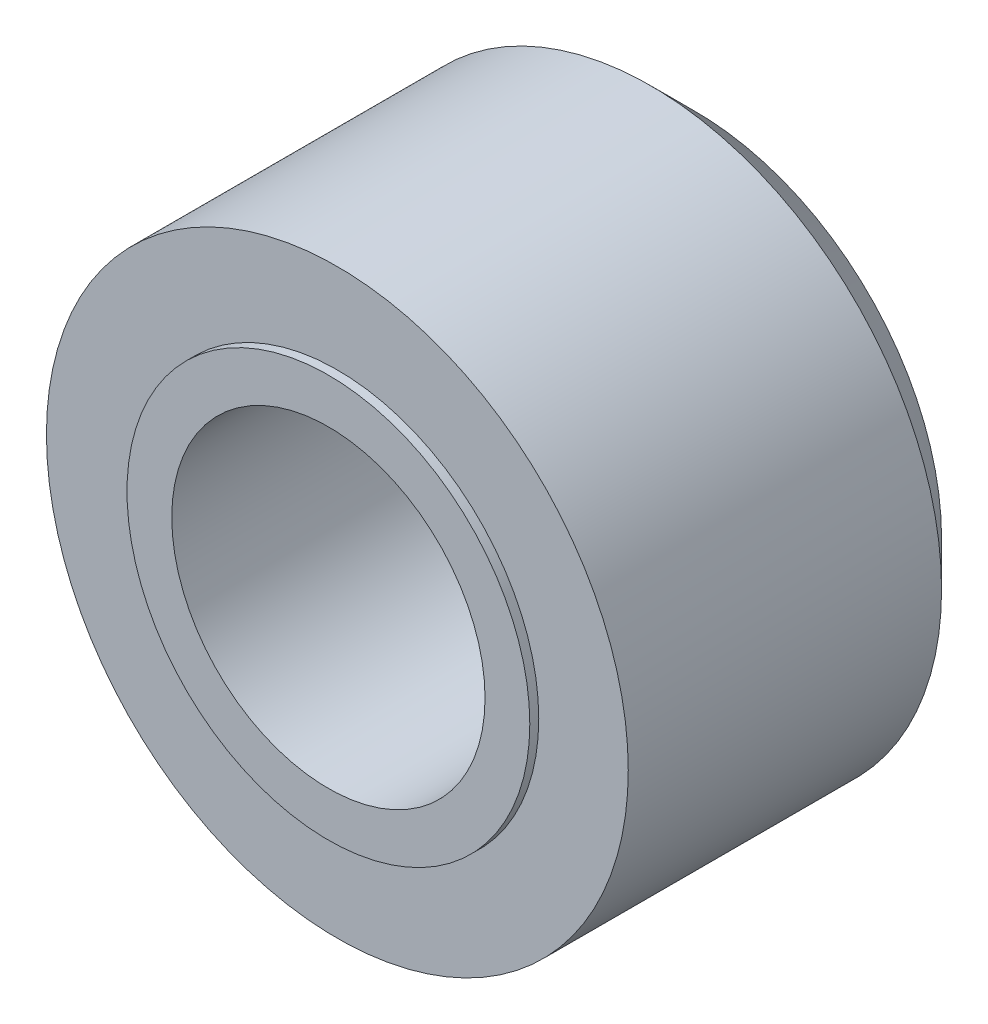
ISO-10303-21;
HEADER;
FILE_DESCRIPTION(('STEP AP214'),'2;1');
FILE_NAME('part.step','',(''),(''),'','','');
FILE_SCHEMA(('AUTOMOTIVE_DESIGN { 1 0 10303 214 1 1 1 1 }'));
ENDSEC;
DATA;
#1=APPLICATION_CONTEXT('core data for automotive mechanical design processes');
#2=APPLICATION_PROTOCOL_DEFINITION('international standard','automotive_design',2000,#1);
#3=PRODUCT_CONTEXT('',#1,'mechanical');
#4=PRODUCT('Part','Part','',(#3));
#5=PRODUCT_RELATED_PRODUCT_CATEGORY('part','',(#4));
#6=PRODUCT_DEFINITION_FORMATION('','',#4);
#7=PRODUCT_DEFINITION_CONTEXT('part definition',#1,'design');
#8=PRODUCT_DEFINITION('design','',#6,#7);
#9=PRODUCT_DEFINITION_SHAPE('','',#8);
#10=(LENGTH_UNIT() NAMED_UNIT(*) SI_UNIT(.MILLI.,.METRE.));
#11=(NAMED_UNIT(*) PLANE_ANGLE_UNIT() SI_UNIT($,.RADIAN.));
#12=(NAMED_UNIT(*) SI_UNIT($,.STERADIAN.) SOLID_ANGLE_UNIT());
#13=UNCERTAINTY_MEASURE_WITH_UNIT(LENGTH_MEASURE(1.E-05),#10,'distance_accuracy_value','');
#14=(GEOMETRIC_REPRESENTATION_CONTEXT(3) GLOBAL_UNCERTAINTY_ASSIGNED_CONTEXT((#13)) GLOBAL_UNIT_ASSIGNED_CONTEXT((#10,
#11,#12)) REPRESENTATION_CONTEXT('',''));
#15=CARTESIAN_POINT('',(0.,0.,0.));
#16=DIRECTION('',(0.,0.,1.));
#17=DIRECTION('',(1.,0.,0.));
#18=AXIS2_PLACEMENT_3D('',#15,#16,#17);
#19=CARTESIAN_POINT('',(0.,0.,4.));
#20=DIRECTION('',(0.,0.,1.));
#21=DIRECTION('',(1.,0.,0.));
#22=AXIS2_PLACEMENT_3D('',#19,#20,#21);
#23=PLANE('',#22);
#24=CARTESIAN_POINT('',(0.,0.,4.));
#25=DIRECTION('',(0.,0.,1.));
#26=DIRECTION('',(1.,0.,0.));
#27=AXIS2_PLACEMENT_3D('',#24,#25,#26);
#28=CIRCLE('',#27,3.25);
#29=CARTESIAN_POINT('',(3.25,0.,4.));
#30=VERTEX_POINT('',#29);
#31=EDGE_CURVE('E42',#30,#30,#28,.T.);
#32=ORIENTED_EDGE('',*,*,#31,.T.);
#33=EDGE_LOOP('',(#32));
#34=FACE_BOUND('',#33,.T.);
#35=CARTESIAN_POINT('',(0.,0.,4.));
#36=DIRECTION('',(0.,0.,1.));
#37=DIRECTION('',(1.,0.,0.));
#38=AXIS2_PLACEMENT_3D('',#35,#36,#37);
#39=CIRCLE('',#38,2.25);
#40=CARTESIAN_POINT('',(2.25,0.,4.));
#41=VERTEX_POINT('',#40);
#42=EDGE_CURVE('E52',#41,#41,#39,.T.);
#43=ORIENTED_EDGE('',*,*,#42,.F.);
#44=EDGE_LOOP('',(#43));
#45=FACE_BOUND('',#44,.T.);
#46=ADVANCED_FACE('F31',(#34,#45),#23,.T.);
#47=CARTESIAN_POINT('',(0.,0.,0.));
#48=DIRECTION('',(0.,0.,1.));
#49=DIRECTION('',(1.,0.,0.));
#50=AXIS2_PLACEMENT_3D('',#47,#48,#49);
#51=PLANE('',#50);
#52=CARTESIAN_POINT('',(0.,0.,0.));
#53=DIRECTION('',(0.,0.,1.));
#54=DIRECTION('',(1.,0.,0.));
#55=AXIS2_PLACEMENT_3D('',#52,#53,#54);
#56=CIRCLE('',#55,2.75);
#57=CARTESIAN_POINT('',(2.75,0.,0.));
#58=VERTEX_POINT('',#57);
#59=EDGE_CURVE('E10',#58,#58,#56,.F.);
#60=ORIENTED_EDGE('',*,*,#59,.T.);
#61=EDGE_LOOP('',(#60));
#62=FACE_BOUND('',#61,.T.);
#63=CARTESIAN_POINT('',(0.,0.,0.));
#64=DIRECTION('',(0.,0.,1.));
#65=DIRECTION('',(1.,0.,0.));
#66=AXIS2_PLACEMENT_3D('',#63,#64,#65);
#67=CIRCLE('',#66,1.75);
#68=CARTESIAN_POINT('',(1.75,0.,0.));
#69=VERTEX_POINT('',#68);
#70=EDGE_CURVE('E46',#69,#69,#67,.T.);
#71=ORIENTED_EDGE('',*,*,#70,.T.);
#72=EDGE_LOOP('',(#71));
#73=FACE_BOUND('',#72,.T.);
#74=ADVANCED_FACE('F78',(#62,#73),#51,.F.);
#75=CARTESIAN_POINT('',(0.,0.,4.));
#76=DIRECTION('',(0.,0.,-1.));
#77=DIRECTION('',(-1.,0.,0.));
#78=AXIS2_PLACEMENT_3D('',#75,#76,#77);
#79=CYLINDRICAL_SURFACE('',#78,3.25);
#80=CARTESIAN_POINT('',(0.,0.,0.500000000000003));
#81=DIRECTION('',(0.,0.,1.));
#82=DIRECTION('',(1.,0.,0.));
#83=AXIS2_PLACEMENT_3D('',#80,#81,#82);
#84=CIRCLE('',#83,3.25);
#85=CARTESIAN_POINT('',(3.25,0.,0.500000000000003));
#86=VERTEX_POINT('',#85);
#87=EDGE_CURVE('E38',#86,#86,#84,.T.);
#88=ORIENTED_EDGE('',*,*,#87,.T.);
#89=EDGE_LOOP('',(#88));
#90=FACE_BOUND('',#89,.T.);
#91=ORIENTED_EDGE('',*,*,#31,.F.);
#92=EDGE_LOOP('',(#91));
#93=FACE_BOUND('',#92,.T.);
#94=ADVANCED_FACE('F74',(#90,#93),#79,.T.);
#95=CARTESIAN_POINT('',(0.,0.,4.));
#96=DIRECTION('',(0.,0.,-1.));
#97=DIRECTION('',(-1.,0.,0.));
#98=AXIS2_PLACEMENT_3D('',#95,#96,#97);
#99=CYLINDRICAL_SURFACE('',#98,1.75);
#100=ORIENTED_EDGE('',*,*,#70,.F.);
#101=EDGE_LOOP('',(#100));
#102=FACE_BOUND('',#101,.T.);
#103=CARTESIAN_POINT('',(0.,0.,4.1));
#104=DIRECTION('',(0.,0.,1.));
#105=DIRECTION('',(1.,0.,0.));
#106=AXIS2_PLACEMENT_3D('',#103,#104,#105);
#107=CIRCLE('',#106,1.75);
#108=CARTESIAN_POINT('',(1.75,0.,4.1));
#109=VERTEX_POINT('',#108);
#110=EDGE_CURVE('E55',#109,#109,#107,.T.);
#111=ORIENTED_EDGE('',*,*,#110,.T.);
#112=EDGE_LOOP('',(#111));
#113=FACE_BOUND('',#112,.T.);
#114=ADVANCED_FACE('F61',(#102,#113),#99,.F.);
#115=CARTESIAN_POINT('',(0.,0.,4.1));
#116=DIRECTION('',(0.,0.,1.));
#117=DIRECTION('',(1.,0.,0.));
#118=AXIS2_PLACEMENT_3D('',#115,#116,#117);
#119=PLANE('',#118);
#120=CARTESIAN_POINT('',(0.,0.,4.1));
#121=DIRECTION('',(0.,0.,1.));
#122=DIRECTION('',(1.,0.,0.));
#123=AXIS2_PLACEMENT_3D('',#120,#121,#122);
#124=CIRCLE('',#123,2.25);
#125=CARTESIAN_POINT('',(2.25,0.,4.1));
#126=VERTEX_POINT('',#125);
#127=EDGE_CURVE('E51',#126,#126,#124,.T.);
#128=ORIENTED_EDGE('',*,*,#127,.T.);
#129=EDGE_LOOP('',(#128));
#130=FACE_BOUND('',#129,.T.);
#131=ORIENTED_EDGE('',*,*,#110,.F.);
#132=EDGE_LOOP('',(#131));
#133=FACE_BOUND('',#132,.T.);
#134=ADVANCED_FACE('F63',(#130,#133),#119,.T.);
#135=CARTESIAN_POINT('',(0.,0.,4.1));
#136=DIRECTION('',(0.,0.,-1.));
#137=DIRECTION('',(-1.,0.,0.));
#138=AXIS2_PLACEMENT_3D('',#135,#136,#137);
#139=CYLINDRICAL_SURFACE('',#138,2.25);
#140=ORIENTED_EDGE('',*,*,#127,.F.);
#141=EDGE_LOOP('',(#140));
#142=FACE_BOUND('',#141,.T.);
#143=ORIENTED_EDGE('',*,*,#42,.T.);
#144=EDGE_LOOP('',(#143));
#145=FACE_BOUND('',#144,.T.);
#146=ADVANCED_FACE('F65',(#142,#145),#139,.T.);
#147=CARTESIAN_POINT('',(0.,0.,0.500000000000003));
#148=DIRECTION('',(0.,0.,1.));
#149=DIRECTION('',(1.,0.,0.));
#150=AXIS2_PLACEMENT_3D('',#147,#148,#149);
#151=CONICAL_SURFACE('',#150,3.25,0.78539816339745);
#152=ORIENTED_EDGE('',*,*,#59,.F.);
#153=EDGE_LOOP('',(#152));
#154=FACE_BOUND('',#153,.T.);
#155=ORIENTED_EDGE('',*,*,#87,.F.);
#156=EDGE_LOOP('',(#155));
#157=FACE_BOUND('',#156,.T.);
#158=ADVANCED_FACE('F33',(#154,#157),#151,.T.);
#159=CLOSED_SHELL('',(#46,#74,#94,#114,#134,#146,#158));
#160=MANIFOLD_SOLID_BREP('B2',#159);
#161=ADVANCED_BREP_SHAPE_REPRESENTATION('',(#18,#160),#14);
#162=SHAPE_DEFINITION_REPRESENTATION(#9,#161);
ENDSEC;
END-ISO-10303-21;
